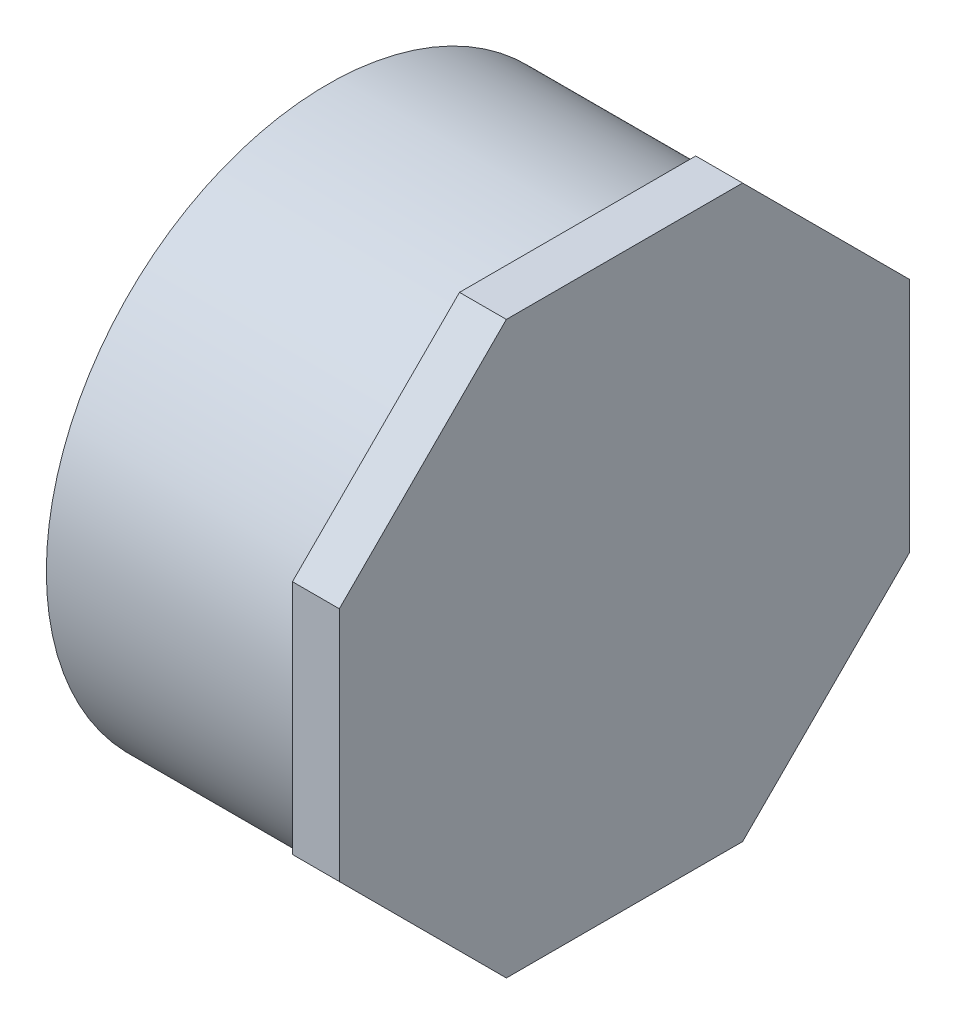
ISO-10303-21;
HEADER;
FILE_DESCRIPTION(('STEP AP214'),'2;1');
FILE_NAME('part.step','',(''),(''),'','','');
FILE_SCHEMA(('AUTOMOTIVE_DESIGN { 1 0 10303 214 1 1 1 1 }'));
ENDSEC;
DATA;
#1=APPLICATION_CONTEXT('core data for automotive mechanical design processes');
#2=APPLICATION_PROTOCOL_DEFINITION('international standard','automotive_design',2000,#1);
#3=PRODUCT_CONTEXT('',#1,'mechanical');
#4=PRODUCT('Part','Part','',(#3));
#5=PRODUCT_RELATED_PRODUCT_CATEGORY('part','',(#4));
#6=PRODUCT_DEFINITION_FORMATION('','',#4);
#7=PRODUCT_DEFINITION_CONTEXT('part definition',#1,'design');
#8=PRODUCT_DEFINITION('design','',#6,#7);
#9=PRODUCT_DEFINITION_SHAPE('','',#8);
#10=(LENGTH_UNIT() NAMED_UNIT(*) SI_UNIT(.MILLI.,.METRE.));
#11=(NAMED_UNIT(*) PLANE_ANGLE_UNIT() SI_UNIT($,.RADIAN.));
#12=(NAMED_UNIT(*) SI_UNIT($,.STERADIAN.) SOLID_ANGLE_UNIT());
#13=UNCERTAINTY_MEASURE_WITH_UNIT(LENGTH_MEASURE(1.E-05),#10,'distance_accuracy_value','');
#14=(GEOMETRIC_REPRESENTATION_CONTEXT(3) GLOBAL_UNCERTAINTY_ASSIGNED_CONTEXT((#13)) GLOBAL_UNIT_ASSIGNED_CONTEXT((#10,
#11,#12)) REPRESENTATION_CONTEXT('',''));
#15=CARTESIAN_POINT('',(0.,0.,0.));
#16=DIRECTION('',(0.,0.,1.));
#17=DIRECTION('',(1.,0.,0.));
#18=AXIS2_PLACEMENT_3D('',#15,#16,#17);
#19=CARTESIAN_POINT('',(-30.1625,0.,0.));
#20=DIRECTION('',(-1.,0.,0.));
#21=DIRECTION('',(0.,0.,1.));
#22=AXIS2_PLACEMENT_3D('',#19,#20,#21);
#23=CYLINDRICAL_SURFACE('',#22,57.15);
#24=CARTESIAN_POINT('',(-30.1625,0.,0.));
#25=DIRECTION('',(-1.,0.,0.));
#26=DIRECTION('',(0.,0.,1.));
#27=AXIS2_PLACEMENT_3D('',#24,#25,#26);
#28=CIRCLE('',#27,57.15);
#29=CARTESIAN_POINT('',(-30.1625,0.,57.15));
#30=VERTEX_POINT('',#29);
#31=EDGE_CURVE('E13',#30,#30,#28,.T.);
#32=ORIENTED_EDGE('',*,*,#31,.F.);
#33=EDGE_LOOP('',(#32));
#34=FACE_BOUND('',#33,.T.);
#35=CARTESIAN_POINT('',(20.6375,2.22044604925031E-13,0.));
#36=DIRECTION('',(1.,0.,0.));
#37=DIRECTION('',(0.,0.,-1.));
#38=AXIS2_PLACEMENT_3D('',#35,#36,#37);
#39=CIRCLE('',#38,57.15);
#40=CARTESIAN_POINT('',(20.6375,2.22044604925031E-13,-57.15));
#41=VERTEX_POINT('',#40);
#42=EDGE_CURVE('E150',#41,#41,#39,.T.);
#43=ORIENTED_EDGE('',*,*,#42,.F.);
#44=EDGE_LOOP('',(#43));
#45=FACE_BOUND('',#44,.T.);
#46=ADVANCED_FACE('F46',(#34,#45),#23,.T.);
#47=CARTESIAN_POINT('',(-30.1625,-51.1302,0.));
#48=DIRECTION('',(-1.,0.,0.));
#49=DIRECTION('',(0.,0.,1.));
#50=AXIS2_PLACEMENT_3D('',#47,#48,#49);
#51=PLANE('',#50);
#52=ORIENTED_EDGE('',*,*,#31,.T.);
#53=EDGE_LOOP('',(#52));
#54=FACE_BOUND('',#53,.T.);
#55=CARTESIAN_POINT('',(-30.1625,0.,0.));
#56=DIRECTION('',(-1.,0.,0.));
#57=DIRECTION('',(0.,0.,1.));
#58=AXIS2_PLACEMENT_3D('',#55,#56,#57);
#59=CIRCLE('',#58,51.1302);
#60=CARTESIAN_POINT('',(-30.1625,0.,51.1302));
#61=VERTEX_POINT('',#60);
#62=EDGE_CURVE('E170',#61,#61,#59,.T.);
#63=ORIENTED_EDGE('',*,*,#62,.F.);
#64=EDGE_LOOP('',(#63));
#65=FACE_BOUND('',#64,.T.);
#66=ADVANCED_FACE('F48',(#54,#65),#51,.T.);
#67=CARTESIAN_POINT('',(20.6375,2.22044604925031E-13,0.));
#68=DIRECTION('',(-1.,0.,0.));
#69=DIRECTION('',(0.,0.,1.));
#70=AXIS2_PLACEMENT_3D('',#67,#68,#69);
#71=PLANE('',#70);
#72=CARTESIAN_POINT('',(20.6375,2.22044604925031E-13,0.));
#73=DIRECTION('',(-1.,0.,0.));
#74=DIRECTION('',(0.,0.,1.));
#75=AXIS2_PLACEMENT_3D('',#72,#73,#74);
#76=CIRCLE('',#75,51.1302);
#77=CARTESIAN_POINT('',(20.6375,2.22044604925031E-13,51.1302));
#78=VERTEX_POINT('',#77);
#79=EDGE_CURVE('E55',#78,#78,#76,.T.);
#80=ORIENTED_EDGE('',*,*,#79,.T.);
#81=EDGE_LOOP('',(#80));
#82=FACE_BOUND('',#81,.T.);
#83=ADVANCED_FACE('F185',(#82),#71,.T.);
#84=CARTESIAN_POINT('',(-30.1625,0.,0.));
#85=DIRECTION('',(-1.,0.,0.));
#86=DIRECTION('',(0.,0.,1.));
#87=AXIS2_PLACEMENT_3D('',#84,#85,#86);
#88=CYLINDRICAL_SURFACE('',#87,51.1302);
#89=ORIENTED_EDGE('',*,*,#62,.T.);
#90=EDGE_LOOP('',(#89));
#91=FACE_BOUND('',#90,.T.);
#92=ORIENTED_EDGE('',*,*,#79,.F.);
#93=EDGE_LOOP('',(#92));
#94=FACE_BOUND('',#93,.T.);
#95=ADVANCED_FACE('F187',(#91,#94),#88,.F.);
#96=CARTESIAN_POINT('',(20.6375,57.9437500000002,-24.001087104756));
#97=DIRECTION('',(0.,1.,0.));
#98=DIRECTION('',(0.,0.,1.));
#99=AXIS2_PLACEMENT_3D('',#96,#97,#98);
#100=PLANE('',#99);
#101=DIRECTION('',(0.,0.,1.));
#102=VECTOR('',#101,1.);
#103=CARTESIAN_POINT('',(30.1625,57.9437500000002,-24.001087104756));
#104=LINE('',#103,#102);
#105=CARTESIAN_POINT('',(30.1625,57.9437500000002,-24.001087104756));
#106=VERTEX_POINT('',#105);
#107=CARTESIAN_POINT('',(30.1625,57.9437500000002,24.001087104756));
#108=VERTEX_POINT('',#107);
#109=EDGE_CURVE('E146',#106,#108,#104,.T.);
#110=ORIENTED_EDGE('',*,*,#109,.F.);
#111=DIRECTION('',(1.,0.,0.));
#112=VECTOR('',#111,1.);
#113=CARTESIAN_POINT('',(20.6375,57.9437500000002,-24.001087104756));
#114=LINE('',#113,#112);
#115=CARTESIAN_POINT('',(20.6375,57.9437500000002,-24.001087104756));
#116=VERTEX_POINT('',#115);
#117=EDGE_CURVE('E63',#116,#106,#114,.T.);
#118=ORIENTED_EDGE('',*,*,#117,.F.);
#119=DIRECTION('',(0.,0.,1.));
#120=VECTOR('',#119,1.);
#121=CARTESIAN_POINT('',(20.6375,57.9437500000002,-24.001087104756));
#122=LINE('',#121,#120);
#123=CARTESIAN_POINT('',(20.6375,57.9437500000002,24.001087104756));
#124=VERTEX_POINT('',#123);
#125=EDGE_CURVE('E168',#116,#124,#122,.T.);
#126=ORIENTED_EDGE('',*,*,#125,.T.);
#127=DIRECTION('',(1.,0.,0.));
#128=VECTOR('',#127,1.);
#129=CARTESIAN_POINT('',(20.6375,57.9437500000002,24.001087104756));
#130=LINE('',#129,#128);
#131=EDGE_CURVE('E104',#124,#108,#130,.T.);
#132=ORIENTED_EDGE('',*,*,#131,.T.);
#133=EDGE_LOOP('',(#110,#118,#126,#132));
#134=FACE_BOUND('',#133,.T.);
#135=ADVANCED_FACE('F189',(#134),#100,.T.);
#136=CARTESIAN_POINT('',(20.6375,24.0010871047562,-57.94375));
#137=DIRECTION('',(0.,0.707106781186548,-0.707106781186548));
#138=DIRECTION('',(0.,0.707106781186548,0.707106781186548));
#139=AXIS2_PLACEMENT_3D('',#136,#137,#138);
#140=PLANE('',#139);
#141=DIRECTION('',(0.,0.707106781186548,0.707106781186548));
#142=VECTOR('',#141,1.);
#143=CARTESIAN_POINT('',(30.1625,24.0010871047562,-57.94375));
#144=LINE('',#143,#142);
#145=CARTESIAN_POINT('',(30.1625,24.0010871047562,-57.94375));
#146=VERTEX_POINT('',#145);
#147=EDGE_CURVE('E165',#146,#106,#144,.T.);
#148=ORIENTED_EDGE('',*,*,#147,.F.);
#149=DIRECTION('',(1.,0.,0.));
#150=VECTOR('',#149,1.);
#151=CARTESIAN_POINT('',(20.6375,24.0010871047562,-57.94375));
#152=LINE('',#151,#150);
#153=CARTESIAN_POINT('',(20.6375,24.0010871047562,-57.94375));
#154=VERTEX_POINT('',#153);
#155=EDGE_CURVE('E92',#154,#146,#152,.T.);
#156=ORIENTED_EDGE('',*,*,#155,.F.);
#157=DIRECTION('',(0.,0.707106781186548,0.707106781186548));
#158=VECTOR('',#157,1.);
#159=CARTESIAN_POINT('',(20.6375,24.0010871047562,-57.94375));
#160=LINE('',#159,#158);
#161=EDGE_CURVE('E136',#154,#116,#160,.T.);
#162=ORIENTED_EDGE('',*,*,#161,.T.);
#163=ORIENTED_EDGE('',*,*,#117,.T.);
#164=EDGE_LOOP('',(#148,#156,#162,#163));
#165=FACE_BOUND('',#164,.T.);
#166=ADVANCED_FACE('F196',(#165),#140,.T.);
#167=CARTESIAN_POINT('',(20.6375,-24.0010871047558,-57.94375));
#168=DIRECTION('',(0.,0.,-1.));
#169=DIRECTION('',(0.,1.,0.));
#170=AXIS2_PLACEMENT_3D('',#167,#168,#169);
#171=PLANE('',#170);
#172=DIRECTION('',(0.,1.,0.));
#173=VECTOR('',#172,1.);
#174=CARTESIAN_POINT('',(30.1625,-24.0010871047558,-57.94375));
#175=LINE('',#174,#173);
#176=CARTESIAN_POINT('',(30.1625,-24.0010871047558,-57.94375));
#177=VERTEX_POINT('',#176);
#178=EDGE_CURVE('E123',#177,#146,#175,.T.);
#179=ORIENTED_EDGE('',*,*,#178,.F.);
#180=DIRECTION('',(1.,0.,0.));
#181=VECTOR('',#180,1.);
#182=CARTESIAN_POINT('',(20.6375,-24.0010871047558,-57.94375));
#183=LINE('',#182,#181);
#184=CARTESIAN_POINT('',(20.6375,-24.0010871047558,-57.94375));
#185=VERTEX_POINT('',#184);
#186=EDGE_CURVE('E118',#185,#177,#183,.T.);
#187=ORIENTED_EDGE('',*,*,#186,.F.);
#188=DIRECTION('',(0.,1.,0.));
#189=VECTOR('',#188,1.);
#190=CARTESIAN_POINT('',(20.6375,-24.0010871047558,-57.94375));
#191=LINE('',#190,#189);
#192=EDGE_CURVE('E121',#185,#154,#191,.T.);
#193=ORIENTED_EDGE('',*,*,#192,.T.);
#194=ORIENTED_EDGE('',*,*,#155,.T.);
#195=EDGE_LOOP('',(#179,#187,#193,#194));
#196=FACE_BOUND('',#195,.T.);
#197=ADVANCED_FACE('F120',(#196),#171,.T.);
#198=CARTESIAN_POINT('',(20.6375,-57.9437499999997,-24.001087104756));
#199=DIRECTION('',(0.,-0.707106781186547,-0.707106781186548));
#200=DIRECTION('',(0.,0.707106781186548,-0.707106781186547));
#201=AXIS2_PLACEMENT_3D('',#198,#199,#200);
#202=PLANE('',#201);
#203=DIRECTION('',(0.,0.707106781186548,-0.707106781186547));
#204=VECTOR('',#203,1.);
#205=CARTESIAN_POINT('',(30.1625,-57.94375,-24.001087104756));
#206=LINE('',#205,#204);
#207=CARTESIAN_POINT('',(30.1625,-57.94375,-24.001087104756));
#208=VERTEX_POINT('',#207);
#209=EDGE_CURVE('E162',#208,#177,#206,.T.);
#210=ORIENTED_EDGE('',*,*,#209,.F.);
#211=DIRECTION('',(1.,0.,0.));
#212=VECTOR('',#211,1.);
#213=CARTESIAN_POINT('',(20.6375,-57.9437499999997,-24.001087104756));
#214=LINE('',#213,#212);
#215=CARTESIAN_POINT('',(20.6375,-57.9437499999997,-24.001087104756));
#216=VERTEX_POINT('',#215);
#217=EDGE_CURVE('E128',#216,#208,#214,.T.);
#218=ORIENTED_EDGE('',*,*,#217,.F.);
#219=DIRECTION('',(0.,0.707106781186548,-0.707106781186547));
#220=VECTOR('',#219,1.);
#221=CARTESIAN_POINT('',(20.6375,-57.9437499999997,-24.001087104756));
#222=LINE('',#221,#220);
#223=EDGE_CURVE('E134',#216,#185,#222,.T.);
#224=ORIENTED_EDGE('',*,*,#223,.T.);
#225=ORIENTED_EDGE('',*,*,#186,.T.);
#226=EDGE_LOOP('',(#210,#218,#224,#225));
#227=FACE_BOUND('',#226,.T.);
#228=ADVANCED_FACE('F138',(#227),#202,.T.);
#229=CARTESIAN_POINT('',(20.6375,-57.94375,24.001087104756));
#230=DIRECTION('',(0.,-1.,0.));
#231=DIRECTION('',(0.,0.,-1.));
#232=AXIS2_PLACEMENT_3D('',#229,#230,#231);
#233=PLANE('',#232);
#234=DIRECTION('',(0.,0.,-1.));
#235=VECTOR('',#234,1.);
#236=CARTESIAN_POINT('',(30.1625,-57.94375,24.001087104756));
#237=LINE('',#236,#235);
#238=CARTESIAN_POINT('',(30.1625,-57.94375,24.001087104756));
#239=VERTEX_POINT('',#238);
#240=EDGE_CURVE('E159',#239,#208,#237,.T.);
#241=ORIENTED_EDGE('',*,*,#240,.F.);
#242=DIRECTION('',(1.,0.,0.));
#243=VECTOR('',#242,1.);
#244=CARTESIAN_POINT('',(20.6375,-57.94375,24.001087104756));
#245=LINE('',#244,#243);
#246=CARTESIAN_POINT('',(20.6375,-57.94375,24.001087104756));
#247=VERTEX_POINT('',#246);
#248=EDGE_CURVE('E173',#247,#239,#245,.T.);
#249=ORIENTED_EDGE('',*,*,#248,.F.);
#250=DIRECTION('',(0.,0.,-1.));
#251=VECTOR('',#250,1.);
#252=CARTESIAN_POINT('',(20.6375,-57.94375,24.001087104756));
#253=LINE('',#252,#251);
#254=EDGE_CURVE('E139',#247,#216,#253,.T.);
#255=ORIENTED_EDGE('',*,*,#254,.T.);
#256=ORIENTED_EDGE('',*,*,#217,.T.);
#257=EDGE_LOOP('',(#241,#249,#255,#256));
#258=FACE_BOUND('',#257,.T.);
#259=ADVANCED_FACE('F230',(#258),#233,.T.);
#260=CARTESIAN_POINT('',(20.6375,-24.0010871047558,57.94375));
#261=DIRECTION('',(0.,-0.707106781186548,0.707106781186547));
#262=DIRECTION('',(0.,-0.707106781186547,-0.707106781186548));
#263=AXIS2_PLACEMENT_3D('',#260,#261,#262);
#264=PLANE('',#263);
#265=DIRECTION('',(0.,-0.707106781186547,-0.707106781186548));
#266=VECTOR('',#265,1.);
#267=CARTESIAN_POINT('',(30.1625,-24.0010871047558,57.94375));
#268=LINE('',#267,#266);
#269=CARTESIAN_POINT('',(30.1625,-24.0010871047558,57.94375));
#270=VERTEX_POINT('',#269);
#271=EDGE_CURVE('E156',#270,#239,#268,.T.);
#272=ORIENTED_EDGE('',*,*,#271,.F.);
#273=DIRECTION('',(1.,0.,0.));
#274=VECTOR('',#273,1.);
#275=CARTESIAN_POINT('',(20.6375,-24.0010871047558,57.94375));
#276=LINE('',#275,#274);
#277=CARTESIAN_POINT('',(20.6375,-24.0010871047558,57.94375));
#278=VERTEX_POINT('',#277);
#279=EDGE_CURVE('E175',#278,#270,#276,.T.);
#280=ORIENTED_EDGE('',*,*,#279,.F.);
#281=DIRECTION('',(0.,-0.707106781186547,-0.707106781186548));
#282=VECTOR('',#281,1.);
#283=CARTESIAN_POINT('',(20.6375,-24.0010871047558,57.94375));
#284=LINE('',#283,#282);
#285=EDGE_CURVE('E141',#278,#247,#284,.T.);
#286=ORIENTED_EDGE('',*,*,#285,.T.);
#287=ORIENTED_EDGE('',*,*,#248,.T.);
#288=EDGE_LOOP('',(#272,#280,#286,#287));
#289=FACE_BOUND('',#288,.T.);
#290=ADVANCED_FACE('F226',(#289),#264,.T.);
#291=CARTESIAN_POINT('',(20.6375,24.0010871047562,57.94375));
#292=DIRECTION('',(0.,0.,1.));
#293=DIRECTION('',(0.,-1.,0.));
#294=AXIS2_PLACEMENT_3D('',#291,#292,#293);
#295=PLANE('',#294);
#296=DIRECTION('',(0.,-1.,0.));
#297=VECTOR('',#296,1.);
#298=CARTESIAN_POINT('',(30.1625,24.0010871047562,57.94375));
#299=LINE('',#298,#297);
#300=CARTESIAN_POINT('',(30.1625,24.0010871047562,57.94375));
#301=VERTEX_POINT('',#300);
#302=EDGE_CURVE('E153',#301,#270,#299,.T.);
#303=ORIENTED_EDGE('',*,*,#302,.F.);
#304=DIRECTION('',(1.,0.,0.));
#305=VECTOR('',#304,1.);
#306=CARTESIAN_POINT('',(20.6375,24.0010871047562,57.94375));
#307=LINE('',#306,#305);
#308=CARTESIAN_POINT('',(20.6375,24.0010871047562,57.94375));
#309=VERTEX_POINT('',#308);
#310=EDGE_CURVE('E178',#309,#301,#307,.T.);
#311=ORIENTED_EDGE('',*,*,#310,.F.);
#312=DIRECTION('',(0.,-1.,0.));
#313=VECTOR('',#312,1.);
#314=CARTESIAN_POINT('',(20.6375,24.0010871047562,57.94375));
#315=LINE('',#314,#313);
#316=EDGE_CURVE('E298',#309,#278,#315,.T.);
#317=ORIENTED_EDGE('',*,*,#316,.T.);
#318=ORIENTED_EDGE('',*,*,#279,.T.);
#319=EDGE_LOOP('',(#303,#311,#317,#318));
#320=FACE_BOUND('',#319,.T.);
#321=ADVANCED_FACE('F222',(#320),#295,.T.);
#322=CARTESIAN_POINT('',(20.6375,57.9437500000002,24.001087104756));
#323=DIRECTION('',(0.,0.707106781186547,0.707106781186548));
#324=DIRECTION('',(0.,-0.707106781186548,0.707106781186547));
#325=AXIS2_PLACEMENT_3D('',#322,#323,#324);
#326=PLANE('',#325);
#327=DIRECTION('',(0.,-0.707106781186548,0.707106781186547));
#328=VECTOR('',#327,1.);
#329=CARTESIAN_POINT('',(30.1625,57.9437500000002,24.001087104756));
#330=LINE('',#329,#328);
#331=EDGE_CURVE('E149',#108,#301,#330,.T.);
#332=ORIENTED_EDGE('',*,*,#331,.F.);
#333=ORIENTED_EDGE('',*,*,#131,.F.);
#334=DIRECTION('',(0.,-0.707106781186548,0.707106781186547));
#335=VECTOR('',#334,1.);
#336=CARTESIAN_POINT('',(20.6375,57.9437500000002,24.001087104756));
#337=LINE('',#336,#335);
#338=EDGE_CURVE('E218',#124,#309,#337,.T.);
#339=ORIENTED_EDGE('',*,*,#338,.T.);
#340=ORIENTED_EDGE('',*,*,#310,.T.);
#341=EDGE_LOOP('',(#332,#333,#339,#340));
#342=FACE_BOUND('',#341,.T.);
#343=ADVANCED_FACE('F214',(#342),#326,.T.);
#344=CARTESIAN_POINT('',(20.6375,57.9437500000002,57.94375));
#345=DIRECTION('',(1.,0.,0.));
#346=DIRECTION('',(0.,0.,-1.));
#347=AXIS2_PLACEMENT_3D('',#344,#345,#346);
#348=PLANE('',#347);
#349=ORIENTED_EDGE('',*,*,#42,.T.);
#350=EDGE_LOOP('',(#349));
#351=FACE_BOUND('',#350,.T.);
#352=ORIENTED_EDGE('',*,*,#125,.F.);
#353=ORIENTED_EDGE('',*,*,#161,.F.);
#354=ORIENTED_EDGE('',*,*,#192,.F.);
#355=ORIENTED_EDGE('',*,*,#223,.F.);
#356=ORIENTED_EDGE('',*,*,#254,.F.);
#357=ORIENTED_EDGE('',*,*,#285,.F.);
#358=ORIENTED_EDGE('',*,*,#316,.F.);
#359=ORIENTED_EDGE('',*,*,#338,.F.);
#360=EDGE_LOOP('',(#352,#353,#354,#355,#356,#357,#358,#359));
#361=FACE_BOUND('',#360,.T.);
#362=ADVANCED_FACE('F132',(#351,#361),#348,.F.);
#363=CARTESIAN_POINT('',(30.1625,2.22044604925031E-13,0.));
#364=DIRECTION('',(1.,0.,0.));
#365=DIRECTION('',(0.,0.,-1.));
#366=AXIS2_PLACEMENT_3D('',#363,#364,#365);
#367=PLANE('',#366);
#368=ORIENTED_EDGE('',*,*,#109,.T.);
#369=ORIENTED_EDGE('',*,*,#331,.T.);
#370=ORIENTED_EDGE('',*,*,#302,.T.);
#371=ORIENTED_EDGE('',*,*,#271,.T.);
#372=ORIENTED_EDGE('',*,*,#240,.T.);
#373=ORIENTED_EDGE('',*,*,#209,.T.);
#374=ORIENTED_EDGE('',*,*,#178,.T.);
#375=ORIENTED_EDGE('',*,*,#147,.T.);
#376=EDGE_LOOP('',(#368,#369,#370,#371,#372,#373,#374,#375));
#377=FACE_BOUND('',#376,.T.);
#378=ADVANCED_FACE('F208',(#377),#367,.T.);
#379=CLOSED_SHELL('',(#46,#66,#83,#95,#135,#166,#197,#228,#259,#290,#321,#343,#362,#378));
#380=MANIFOLD_SOLID_BREP('B2',#379);
#381=ADVANCED_BREP_SHAPE_REPRESENTATION('',(#18,#380),#14);
#382=SHAPE_DEFINITION_REPRESENTATION(#9,#381);
ENDSEC;
END-ISO-10303-21;
